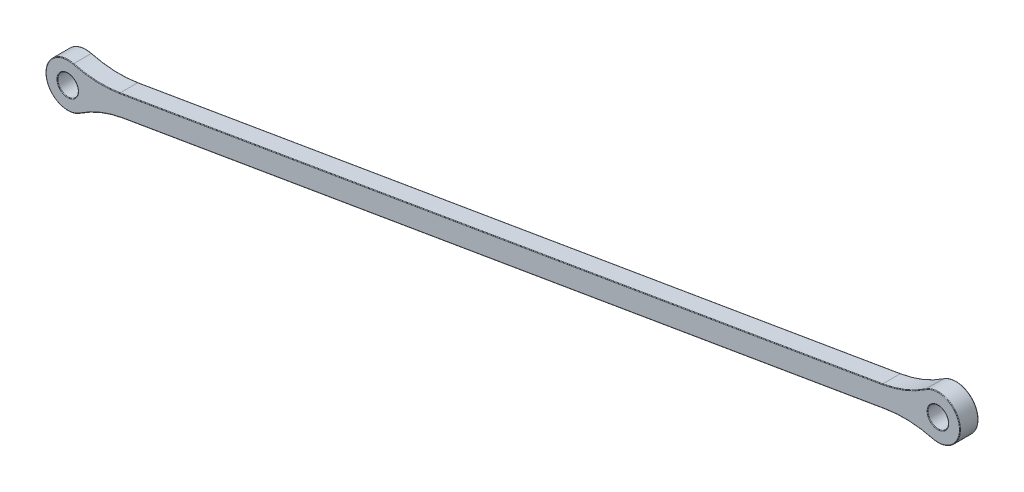
ISO-10303-21;
HEADER;
FILE_DESCRIPTION(('STEP AP214'),'2;1');
FILE_NAME('part.step','',(''),(''),'','','');
FILE_SCHEMA(('AUTOMOTIVE_DESIGN { 1 0 10303 214 1 1 1 1 }'));
ENDSEC;
DATA;
#1=APPLICATION_CONTEXT('core data for automotive mechanical design processes');
#2=APPLICATION_PROTOCOL_DEFINITION('international standard','automotive_design',2000,#1);
#3=PRODUCT_CONTEXT('',#1,'mechanical');
#4=PRODUCT('Part','Part','',(#3));
#5=PRODUCT_RELATED_PRODUCT_CATEGORY('part','',(#4));
#6=PRODUCT_DEFINITION_FORMATION('','',#4);
#7=PRODUCT_DEFINITION_CONTEXT('part definition',#1,'design');
#8=PRODUCT_DEFINITION('design','',#6,#7);
#9=PRODUCT_DEFINITION_SHAPE('','',#8);
#10=(LENGTH_UNIT() NAMED_UNIT(*) SI_UNIT(.MILLI.,.METRE.));
#11=(NAMED_UNIT(*) PLANE_ANGLE_UNIT() SI_UNIT($,.RADIAN.));
#12=(NAMED_UNIT(*) SI_UNIT($,.STERADIAN.) SOLID_ANGLE_UNIT());
#13=UNCERTAINTY_MEASURE_WITH_UNIT(LENGTH_MEASURE(1.E-05),#10,'distance_accuracy_value','');
#14=(GEOMETRIC_REPRESENTATION_CONTEXT(3) GLOBAL_UNCERTAINTY_ASSIGNED_CONTEXT((#13)) GLOBAL_UNIT_ASSIGNED_CONTEXT((#10,
#11,#12)) REPRESENTATION_CONTEXT('',''));
#15=CARTESIAN_POINT('',(0.,0.,0.));
#16=DIRECTION('',(0.,0.,1.));
#17=DIRECTION('',(1.,0.,0.));
#18=AXIS2_PLACEMENT_3D('',#15,#16,#17);
#19=CARTESIAN_POINT('',(-307.976278264637,263.097982683496,-5.));
#20=DIRECTION('',(0.,0.,1.));
#21=DIRECTION('',(1.,0.,0.));
#22=AXIS2_PLACEMENT_3D('',#19,#20,#21);
#23=CYLINDRICAL_SURFACE('',#22,5.99999999999999);
#24=DIRECTION('',(0.,0.,1.));
#25=VECTOR('',#24,1.);
#26=CARTESIAN_POINT('',(-304.624369753048,258.121567374266,-5.));
#27=LINE('',#26,#25);
#28=CARTESIAN_POINT('',(-304.624369753048,258.121567374266,-4.85));
#29=VERTEX_POINT('',#28);
#30=CARTESIAN_POINT('',(-304.624369753048,258.121567374266,-0.15));
#31=VERTEX_POINT('',#30);
#32=EDGE_CURVE('E347',#29,#31,#27,.T.);
#33=ORIENTED_EDGE('',*,*,#32,.T.);
#34=CARTESIAN_POINT('',(-307.976278264637,263.097982683496,-0.15));
#35=DIRECTION('',(0.,0.,1.));
#36=DIRECTION('',(1.,0.,0.));
#37=AXIS2_PLACEMENT_3D('',#34,#35,#36);
#38=CIRCLE('',#37,5.99999999999999);
#39=CARTESIAN_POINT('',(-306.451835718125,268.901091757292,-0.15));
#40=VERTEX_POINT('',#39);
#41=EDGE_CURVE('E211',#31,#40,#38,.F.);
#42=ORIENTED_EDGE('',*,*,#41,.T.);
#43=DIRECTION('',(0.,0.,1.));
#44=VECTOR('',#43,1.);
#45=CARTESIAN_POINT('',(-306.451835718125,268.901091757292,-5.));
#46=LINE('',#45,#44);
#47=CARTESIAN_POINT('',(-306.451835718125,268.901091757292,-4.85));
#48=VERTEX_POINT('',#47);
#49=EDGE_CURVE('E260',#40,#48,#46,.F.);
#50=ORIENTED_EDGE('',*,*,#49,.T.);
#51=CARTESIAN_POINT('',(-307.976278264637,263.097982683496,-4.85));
#52=DIRECTION('',(0.,0.,1.));
#53=DIRECTION('',(1.,0.,0.));
#54=AXIS2_PLACEMENT_3D('',#51,#52,#53);
#55=CIRCLE('',#54,5.99999999999999);
#56=EDGE_CURVE('E209',#48,#29,#55,.T.);
#57=ORIENTED_EDGE('',*,*,#56,.T.);
#58=EDGE_LOOP('',(#33,#42,#50,#57));
#59=FACE_BOUND('',#58,.T.);
#60=ADVANCED_FACE('F39',(#59),#23,.T.);
#61=CARTESIAN_POINT('',(-52.4294141619899,309.261107537726,-5.));
#62=DIRECTION('',(0.167146277293557,-0.985932108203656,0.));
#63=DIRECTION('',(0.985932108203656,0.167146277293557,0.));
#64=AXIS2_PLACEMENT_3D('',#61,#62,#63);
#65=PLANE('',#64);
#66=DIRECTION('',(0.,0.,1.));
#67=VECTOR('',#66,1.);
#68=CARTESIAN_POINT('',(-293.815234666754,268.338673880166,-5.));
#69=LINE('',#68,#67);
#70=CARTESIAN_POINT('',(-293.815234666754,268.338673880166,-4.85));
#71=VERTEX_POINT('',#70);
#72=CARTESIAN_POINT('',(-293.815234666754,268.338673880166,-0.15));
#73=VERTEX_POINT('',#72);
#74=EDGE_CURVE('E306',#71,#73,#69,.T.);
#75=ORIENTED_EDGE('',*,*,#74,.T.);
#76=DIRECTION('',(0.985932108203656,0.167146277293557,0.));
#77=VECTOR('',#76,1.);
#78=CARTESIAN_POINT('',(-86.4496350464867,303.493617843219,-0.15));
#79=LINE('',#78,#77);
#80=CARTESIAN_POINT('',(-86.4496350464867,303.493617843219,-0.15));
#81=VERTEX_POINT('',#80);
#82=EDGE_CURVE('E219',#73,#81,#79,.T.);
#83=ORIENTED_EDGE('',*,*,#82,.T.);
#84=DIRECTION('',(0.,0.,1.));
#85=VECTOR('',#84,1.);
#86=CARTESIAN_POINT('',(-86.4496350464867,303.493617843219,-5.));
#87=LINE('',#86,#85);
#88=CARTESIAN_POINT('',(-86.4496350464867,303.493617843219,-4.85));
#89=VERTEX_POINT('',#88);
#90=EDGE_CURVE('E298',#81,#89,#87,.F.);
#91=ORIENTED_EDGE('',*,*,#90,.T.);
#92=DIRECTION('',(0.985932108203656,0.167146277293557,0.));
#93=VECTOR('',#92,1.);
#94=CARTESIAN_POINT('',(-52.4294141619899,309.261107537726,-4.85));
#95=LINE('',#94,#93);
#96=EDGE_CURVE('E217',#89,#71,#95,.F.);
#97=ORIENTED_EDGE('',*,*,#96,.T.);
#98=EDGE_LOOP('',(#75,#83,#91,#97));
#99=FACE_BOUND('',#98,.T.);
#100=ADVANCED_FACE('F303',(#99),#65,.F.);
#101=CARTESIAN_POINT('',(-71.3525722957598,303.213089233949,-5.));
#102=DIRECTION('',(0.,0.,1.));
#103=DIRECTION('',(1.,0.,0.));
#104=AXIS2_PLACEMENT_3D('',#101,#102,#103);
#105=CYLINDRICAL_SURFACE('',#104,6.);
#106=DIRECTION('',(0.,0.,1.));
#107=VECTOR('',#106,1.);
#108=CARTESIAN_POINT('',(-74.7044808073487,308.189504543179,-5.));
#109=LINE('',#108,#107);
#110=CARTESIAN_POINT('',(-74.7044808073487,308.189504543179,-4.85));
#111=VERTEX_POINT('',#110);
#112=CARTESIAN_POINT('',(-74.7044808073487,308.189504543179,-0.15));
#113=VERTEX_POINT('',#112);
#114=EDGE_CURVE('E300',#111,#113,#109,.T.);
#115=ORIENTED_EDGE('',*,*,#114,.T.);
#116=CARTESIAN_POINT('',(-71.3525722957598,303.213089233949,-0.15));
#117=DIRECTION('',(0.,0.,1.));
#118=DIRECTION('',(1.,0.,0.));
#119=AXIS2_PLACEMENT_3D('',#116,#117,#118);
#120=CIRCLE('',#119,6.);
#121=CARTESIAN_POINT('',(-72.8770148422724,297.409980160153,-0.15));
#122=VERTEX_POINT('',#121);
#123=EDGE_CURVE('E194',#113,#122,#120,.F.);
#124=ORIENTED_EDGE('',*,*,#123,.T.);
#125=DIRECTION('',(0.,0.,1.));
#126=VECTOR('',#125,1.);
#127=CARTESIAN_POINT('',(-72.8770148422724,297.409980160153,-5.));
#128=LINE('',#127,#126);
#129=CARTESIAN_POINT('',(-72.8770148422724,297.409980160153,-4.85));
#130=VERTEX_POINT('',#129);
#131=EDGE_CURVE('E311',#122,#130,#128,.F.);
#132=ORIENTED_EDGE('',*,*,#131,.T.);
#133=CARTESIAN_POINT('',(-71.3525722957598,303.213089233949,-4.85));
#134=DIRECTION('',(0.,0.,1.));
#135=DIRECTION('',(1.,0.,0.));
#136=AXIS2_PLACEMENT_3D('',#133,#134,#135);
#137=CIRCLE('',#136,6.);
#138=EDGE_CURVE('E192',#130,#111,#137,.T.);
#139=ORIENTED_EDGE('',*,*,#138,.T.);
#140=EDGE_LOOP('',(#115,#124,#132,#139));
#141=FACE_BOUND('',#140,.T.);
#142=ADVANCED_FACE('F338',(#141),#105,.T.);
#143=CARTESIAN_POINT('',(-51.493395009146,303.739887731786,-5.));
#144=DIRECTION('',(0.167146277293557,-0.985932108203656,0.));
#145=DIRECTION('',(0.985932108203656,0.167146277293557,0.));
#146=AXIS2_PLACEMENT_3D('',#143,#144,#145);
#147=PLANE('',#146);
#148=DIRECTION('',(0.,0.,-1.));
#149=VECTOR('',#148,1.);
#150=CARTESIAN_POINT('',(-85.5136158936422,297.972398037279,0.));
#151=LINE('',#150,#149);
#152=CARTESIAN_POINT('',(-85.5136158936422,297.972398037279,-4.85));
#153=VERTEX_POINT('',#152);
#154=CARTESIAN_POINT('',(-85.5136158936422,297.972398037279,-0.15));
#155=VERTEX_POINT('',#154);
#156=EDGE_CURVE('E342',#153,#155,#151,.F.);
#157=ORIENTED_EDGE('',*,*,#156,.T.);
#158=DIRECTION('',(0.985932108203656,0.167146277293557,0.));
#159=VECTOR('',#158,1.);
#160=CARTESIAN_POINT('',(-51.493395009146,303.739887731786,-0.15));
#161=LINE('',#160,#159);
#162=CARTESIAN_POINT('',(-292.879215513911,262.817454074226,-0.15));
#163=VERTEX_POINT('',#162);
#164=EDGE_CURVE('E202',#155,#163,#161,.F.);
#165=ORIENTED_EDGE('',*,*,#164,.T.);
#166=DIRECTION('',(0.,0.,-1.));
#167=VECTOR('',#166,1.);
#168=CARTESIAN_POINT('',(-292.879215513911,262.817454074226,-5.));
#169=LINE('',#168,#167);
#170=CARTESIAN_POINT('',(-292.879215513911,262.817454074226,-4.85));
#171=VERTEX_POINT('',#170);
#172=EDGE_CURVE('E339',#163,#171,#169,.T.);
#173=ORIENTED_EDGE('',*,*,#172,.T.);
#174=DIRECTION('',(0.985932108203656,0.167146277293557,0.));
#175=VECTOR('',#174,1.);
#176=CARTESIAN_POINT('',(-85.5136158936422,297.972398037279,-4.85));
#177=LINE('',#176,#175);
#178=EDGE_CURVE('E200',#171,#153,#177,.T.);
#179=ORIENTED_EDGE('',*,*,#178,.T.);
#180=EDGE_LOOP('',(#157,#165,#173,#179));
#181=FACE_BOUND('',#180,.T.);
#182=ADVANCED_FACE('F377',(#181),#147,.T.);
#183=CARTESIAN_POINT('',(-71.3525722957597,303.213089233949,-5.));
#184=DIRECTION('',(0.,0.,1.));
#185=DIRECTION('',(1.,0.,0.));
#186=AXIS2_PLACEMENT_3D('',#183,#184,#185);
#187=CYLINDRICAL_SURFACE('',#186,2.80000000000004);
#188=CARTESIAN_POINT('',(-71.3525722957597,303.213089233949,-0.15));
#189=DIRECTION('',(0.,0.,1.));
#190=DIRECTION('',(1.,0.,0.));
#191=AXIS2_PLACEMENT_3D('',#188,#189,#190);
#192=CIRCLE('',#191,2.80000000000004);
#193=CARTESIAN_POINT('',(-68.5525722957597,303.213089233949,-0.15));
#194=VERTEX_POINT('',#193);
#195=EDGE_CURVE('E224',#194,#194,#192,.T.);
#196=ORIENTED_EDGE('',*,*,#195,.T.);
#197=EDGE_LOOP('',(#196));
#198=FACE_BOUND('',#197,.T.);
#199=CARTESIAN_POINT('',(-71.3525722957597,303.213089233949,-4.85));
#200=DIRECTION('',(0.,0.,1.));
#201=DIRECTION('',(1.,0.,0.));
#202=AXIS2_PLACEMENT_3D('',#199,#200,#201);
#203=CIRCLE('',#202,2.80000000000004);
#204=CARTESIAN_POINT('',(-68.5525722957597,303.213089233949,-4.85));
#205=VERTEX_POINT('',#204);
#206=EDGE_CURVE('E221',#205,#205,#203,.F.);
#207=ORIENTED_EDGE('',*,*,#206,.T.);
#208=EDGE_LOOP('',(#207));
#209=FACE_BOUND('',#208,.T.);
#210=ADVANCED_FACE('F420',(#198,#209),#187,.F.);
#211=CARTESIAN_POINT('',(-307.976278264637,263.097982683496,-5.));
#212=DIRECTION('',(0.,0.,1.));
#213=DIRECTION('',(1.,0.,0.));
#214=AXIS2_PLACEMENT_3D('',#211,#212,#213);
#215=CYLINDRICAL_SURFACE('',#214,2.80000000000004);
#216=CARTESIAN_POINT('',(-307.976278264637,263.097982683496,-0.15));
#217=DIRECTION('',(0.,0.,1.));
#218=DIRECTION('',(1.,0.,0.));
#219=AXIS2_PLACEMENT_3D('',#216,#217,#218);
#220=CIRCLE('',#219,2.80000000000004);
#221=CARTESIAN_POINT('',(-305.176278264637,263.097982683496,-0.15));
#222=VERTEX_POINT('',#221);
#223=EDGE_CURVE('E309',#222,#222,#220,.T.);
#224=ORIENTED_EDGE('',*,*,#223,.T.);
#225=EDGE_LOOP('',(#224));
#226=FACE_BOUND('',#225,.T.);
#227=CARTESIAN_POINT('',(-307.976278264637,263.097982683496,-4.85));
#228=DIRECTION('',(0.,0.,1.));
#229=DIRECTION('',(1.,0.,0.));
#230=AXIS2_PLACEMENT_3D('',#227,#228,#229);
#231=CIRCLE('',#230,2.80000000000004);
#232=CARTESIAN_POINT('',(-305.176278264637,263.097982683496,-4.85));
#233=VERTEX_POINT('',#232);
#234=EDGE_CURVE('E305',#233,#233,#231,.F.);
#235=ORIENTED_EDGE('',*,*,#234,.T.);
#236=EDGE_LOOP('',(#235));
#237=FACE_BOUND('',#236,.T.);
#238=ADVANCED_FACE('F423',(#226,#237),#215,.F.);
#239=CARTESIAN_POINT('',(0.,0.,-5.));
#240=DIRECTION('',(0.,0.,1.));
#241=DIRECTION('',(1.,0.,0.));
#242=AXIS2_PLACEMENT_3D('',#239,#240,#241);
#243=PLANE('',#242);
#244=CARTESIAN_POINT('',(-307.976278264637,263.097982683496,-5.));
#245=DIRECTION('',(0.,0.,1.));
#246=DIRECTION('',(1.,0.,0.));
#247=AXIS2_PLACEMENT_3D('',#244,#245,#246);
#248=CIRCLE('',#247,2.95000000000004);
#249=CARTESIAN_POINT('',(-305.026278264637,263.097982683496,-5.));
#250=VERTEX_POINT('',#249);
#251=EDGE_CURVE('E11',#250,#250,#248,.T.);
#252=ORIENTED_EDGE('',*,*,#251,.T.);
#253=EDGE_LOOP('',(#252));
#254=FACE_BOUND('',#253,.T.);
#255=DIRECTION('',(0.985932108203656,0.167146277293557,0.));
#256=VECTOR('',#255,1.);
#257=CARTESIAN_POINT('',(-292.904287455505,262.965343890456,-5.));
#258=LINE('',#257,#256);
#259=CARTESIAN_POINT('',(-85.5386878352363,298.120287853509,-5.));
#260=VERTEX_POINT('',#259);
#261=CARTESIAN_POINT('',(-292.904287455505,262.965343890456,-5.));
#262=VERTEX_POINT('',#261);
#263=EDGE_CURVE('E56',#260,#262,#258,.F.);
#264=ORIENTED_EDGE('',*,*,#263,.T.);
#265=CARTESIAN_POINT('',(-287.864827195104,233.239490828116,-5.));
#266=DIRECTION('',(0.,0.,1.));
#267=DIRECTION('',(1.,0.,0.));
#268=AXIS2_PLACEMENT_3D('',#265,#266,#267);
#269=CIRCLE('',#268,30.15);
#270=CARTESIAN_POINT('',(-304.708167465838,258.245977756997,-5.));
#271=VERTEX_POINT('',#270);
#272=EDGE_CURVE('E48',#262,#271,#269,.T.);
#273=ORIENTED_EDGE('',*,*,#272,.T.);
#274=CARTESIAN_POINT('',(-307.976278264637,263.097982683496,-5.));
#275=DIRECTION('',(0.,0.,1.));
#276=DIRECTION('',(1.,0.,0.));
#277=AXIS2_PLACEMENT_3D('',#274,#275,#276);
#278=CIRCLE('',#277,5.84999999999999);
#279=CARTESIAN_POINT('',(-306.489946781787,268.756014030448,-5.));
#280=VERTEX_POINT('',#279);
#281=EDGE_CURVE('E230',#271,#280,#278,.F.);
#282=ORIENTED_EDGE('',*,*,#281,.T.);
#283=CARTESIAN_POINT('',(-298.829622985561,297.916637126276,-5.));
#284=DIRECTION('',(0.,0.,1.));
#285=DIRECTION('',(1.,0.,0.));
#286=AXIS2_PLACEMENT_3D('',#283,#284,#285);
#287=CIRCLE('',#286,30.15);
#288=CARTESIAN_POINT('',(-293.79016272516,268.190784063936,-5.));
#289=VERTEX_POINT('',#288);
#290=EDGE_CURVE('E232',#280,#289,#287,.T.);
#291=ORIENTED_EDGE('',*,*,#290,.T.);
#292=DIRECTION('',(0.985932108203656,0.167146277293557,0.));
#293=VECTOR('',#292,1.);
#294=CARTESIAN_POINT('',(-52.4043422203959,309.113217721496,-5.));
#295=LINE('',#294,#293);
#296=CARTESIAN_POINT('',(-86.4245631048926,303.345728026989,-5.));
#297=VERTEX_POINT('',#296);
#298=EDGE_CURVE('E234',#289,#297,#295,.T.);
#299=ORIENTED_EDGE('',*,*,#298,.T.);
#300=CARTESIAN_POINT('',(-91.4640233652934,333.071581089329,-5.));
#301=DIRECTION('',(0.,0.,1.));
#302=DIRECTION('',(1.,0.,0.));
#303=AXIS2_PLACEMENT_3D('',#300,#301,#302);
#304=CIRCLE('',#303,30.15);
#305=CARTESIAN_POINT('',(-74.620683094559,308.065094160449,-5.));
#306=VERTEX_POINT('',#305);
#307=EDGE_CURVE('E236',#297,#306,#304,.T.);
#308=ORIENTED_EDGE('',*,*,#307,.T.);
#309=CARTESIAN_POINT('',(-71.3525722957598,303.213089233949,-5.));
#310=DIRECTION('',(0.,0.,1.));
#311=DIRECTION('',(1.,0.,0.));
#312=AXIS2_PLACEMENT_3D('',#309,#310,#311);
#313=CIRCLE('',#312,5.85);
#314=CARTESIAN_POINT('',(-72.8389037786096,297.555057886998,-5.));
#315=VERTEX_POINT('',#314);
#316=EDGE_CURVE('E238',#306,#315,#313,.F.);
#317=ORIENTED_EDGE('',*,*,#316,.T.);
#318=CARTESIAN_POINT('',(-80.4992275748355,268.394434791169,-5.));
#319=DIRECTION('',(0.,0.,1.));
#320=DIRECTION('',(1.,0.,0.));
#321=AXIS2_PLACEMENT_3D('',#318,#319,#320);
#322=CIRCLE('',#321,30.15);
#323=EDGE_CURVE('E61',#315,#260,#322,.T.);
#324=ORIENTED_EDGE('',*,*,#323,.T.);
#325=EDGE_LOOP('',(#264,#273,#282,#291,#299,#308,#317,#324));
#326=FACE_BOUND('',#325,.T.);
#327=CARTESIAN_POINT('',(-71.3525722957597,303.213089233949,-5.));
#328=DIRECTION('',(0.,0.,1.));
#329=DIRECTION('',(1.,0.,0.));
#330=AXIS2_PLACEMENT_3D('',#327,#328,#329);
#331=CIRCLE('',#330,2.95000000000004);
#332=CARTESIAN_POINT('',(-68.4025722957597,303.213089233949,-5.));
#333=VERTEX_POINT('',#332);
#334=EDGE_CURVE('E227',#333,#333,#331,.T.);
#335=ORIENTED_EDGE('',*,*,#334,.T.);
#336=EDGE_LOOP('',(#335));
#337=FACE_BOUND('',#336,.T.);
#338=ADVANCED_FACE('F396',(#254,#326,#337),#243,.F.);
#339=CARTESIAN_POINT('',(0.,0.,0.));
#340=DIRECTION('',(0.,0.,1.));
#341=DIRECTION('',(1.,0.,0.));
#342=AXIS2_PLACEMENT_3D('',#339,#340,#341);
#343=PLANE('',#342);
#344=CARTESIAN_POINT('',(-307.976278264637,263.097982683496,0.));
#345=DIRECTION('',(0.,0.,1.));
#346=DIRECTION('',(1.,0.,0.));
#347=AXIS2_PLACEMENT_3D('',#344,#345,#346);
#348=CIRCLE('',#347,2.95000000000004);
#349=CARTESIAN_POINT('',(-305.026278264637,263.097982683496,0.));
#350=VERTEX_POINT('',#349);
#351=EDGE_CURVE('E181',#350,#350,#348,.F.);
#352=ORIENTED_EDGE('',*,*,#351,.T.);
#353=EDGE_LOOP('',(#352));
#354=FACE_BOUND('',#353,.T.);
#355=CARTESIAN_POINT('',(-71.3525722957598,303.213089233949,0.));
#356=DIRECTION('',(0.,0.,1.));
#357=DIRECTION('',(1.,0.,0.));
#358=AXIS2_PLACEMENT_3D('',#355,#356,#357);
#359=CIRCLE('',#358,5.85);
#360=CARTESIAN_POINT('',(-72.8389037786096,297.555057886998,0.));
#361=VERTEX_POINT('',#360);
#362=CARTESIAN_POINT('',(-74.620683094559,308.065094160449,0.));
#363=VERTEX_POINT('',#362);
#364=EDGE_CURVE('E179',#361,#363,#359,.T.);
#365=ORIENTED_EDGE('',*,*,#364,.T.);
#366=CARTESIAN_POINT('',(-91.4640233652934,333.071581089329,0.));
#367=DIRECTION('',(0.,0.,1.));
#368=DIRECTION('',(1.,0.,0.));
#369=AXIS2_PLACEMENT_3D('',#366,#367,#368);
#370=CIRCLE('',#369,30.15);
#371=CARTESIAN_POINT('',(-86.4245631048926,303.345728026989,0.));
#372=VERTEX_POINT('',#371);
#373=EDGE_CURVE('E159',#363,#372,#370,.F.);
#374=ORIENTED_EDGE('',*,*,#373,.T.);
#375=DIRECTION('',(0.985932108203656,0.167146277293557,0.));
#376=VECTOR('',#375,1.);
#377=CARTESIAN_POINT('',(-293.79016272516,268.190784063936,0.));
#378=LINE('',#377,#376);
#379=CARTESIAN_POINT('',(-293.79016272516,268.190784063936,0.));
#380=VERTEX_POINT('',#379);
#381=EDGE_CURVE('E167',#372,#380,#378,.F.);
#382=ORIENTED_EDGE('',*,*,#381,.T.);
#383=CARTESIAN_POINT('',(-298.829622985561,297.916637126276,0.));
#384=DIRECTION('',(0.,0.,1.));
#385=DIRECTION('',(1.,0.,0.));
#386=AXIS2_PLACEMENT_3D('',#383,#384,#385);
#387=CIRCLE('',#386,30.15);
#388=CARTESIAN_POINT('',(-306.489946781787,268.756014030448,0.));
#389=VERTEX_POINT('',#388);
#390=EDGE_CURVE('E173',#380,#389,#387,.F.);
#391=ORIENTED_EDGE('',*,*,#390,.T.);
#392=CARTESIAN_POINT('',(-307.976278264637,263.097982683496,0.));
#393=DIRECTION('',(0.,0.,1.));
#394=DIRECTION('',(1.,0.,0.));
#395=AXIS2_PLACEMENT_3D('',#392,#393,#394);
#396=CIRCLE('',#395,5.84999999999999);
#397=CARTESIAN_POINT('',(-304.708167465838,258.245977756997,0.));
#398=VERTEX_POINT('',#397);
#399=EDGE_CURVE('E320',#389,#398,#396,.T.);
#400=ORIENTED_EDGE('',*,*,#399,.T.);
#401=CARTESIAN_POINT('',(-287.864827195104,233.239490828116,0.));
#402=DIRECTION('',(0.,0.,1.));
#403=DIRECTION('',(1.,0.,0.));
#404=AXIS2_PLACEMENT_3D('',#401,#402,#403);
#405=CIRCLE('',#404,30.15);
#406=CARTESIAN_POINT('',(-292.904287455505,262.965343890456,0.));
#407=VERTEX_POINT('',#406);
#408=EDGE_CURVE('E322',#398,#407,#405,.F.);
#409=ORIENTED_EDGE('',*,*,#408,.T.);
#410=DIRECTION('',(0.985932108203656,0.167146277293557,0.));
#411=VECTOR('',#410,1.);
#412=CARTESIAN_POINT('',(-51.51846695074,303.887777548016,0.));
#413=LINE('',#412,#411);
#414=CARTESIAN_POINT('',(-85.5386878352363,298.120287853509,0.));
#415=VERTEX_POINT('',#414);
#416=EDGE_CURVE('E324',#407,#415,#413,.T.);
#417=ORIENTED_EDGE('',*,*,#416,.T.);
#418=CARTESIAN_POINT('',(-80.4992275748355,268.394434791169,0.));
#419=DIRECTION('',(0.,0.,1.));
#420=DIRECTION('',(1.,0.,0.));
#421=AXIS2_PLACEMENT_3D('',#418,#419,#420);
#422=CIRCLE('',#421,30.15);
#423=EDGE_CURVE('E186',#415,#361,#422,.F.);
#424=ORIENTED_EDGE('',*,*,#423,.T.);
#425=EDGE_LOOP('',(#365,#374,#382,#391,#400,#409,#417,#424));
#426=FACE_BOUND('',#425,.T.);
#427=CARTESIAN_POINT('',(-71.3525722957597,303.213089233949,0.));
#428=DIRECTION('',(0.,0.,1.));
#429=DIRECTION('',(1.,0.,0.));
#430=AXIS2_PLACEMENT_3D('',#427,#428,#429);
#431=CIRCLE('',#430,2.95000000000004);
#432=CARTESIAN_POINT('',(-68.4025722957597,303.213089233949,0.));
#433=VERTEX_POINT('',#432);
#434=EDGE_CURVE('E174',#433,#433,#431,.F.);
#435=ORIENTED_EDGE('',*,*,#434,.T.);
#436=EDGE_LOOP('',(#435));
#437=FACE_BOUND('',#436,.T.);
#438=ADVANCED_FACE('F176',(#354,#426,#437),#343,.T.);
#439=CARTESIAN_POINT('',(-287.864827195104,233.239490828116,-5.));
#440=DIRECTION('',(0.,0.,1.));
#441=DIRECTION('',(1.,0.,0.));
#442=AXIS2_PLACEMENT_3D('',#439,#440,#441);
#443=CYLINDRICAL_SURFACE('',#442,30.);
#444=ORIENTED_EDGE('',*,*,#172,.F.);
#445=CARTESIAN_POINT('',(-287.864827195104,233.239490828116,-0.15));
#446=DIRECTION('',(0.,0.,1.));
#447=DIRECTION('',(1.,0.,0.));
#448=AXIS2_PLACEMENT_3D('',#445,#446,#447);
#449=CIRCLE('',#448,30.);
#450=EDGE_CURVE('E207',#163,#31,#449,.T.);
#451=ORIENTED_EDGE('',*,*,#450,.T.);
#452=ORIENTED_EDGE('',*,*,#32,.F.);
#453=CARTESIAN_POINT('',(-287.864827195104,233.239490828116,-4.85));
#454=DIRECTION('',(0.,0.,1.));
#455=DIRECTION('',(1.,0.,0.));
#456=AXIS2_PLACEMENT_3D('',#453,#454,#455);
#457=CIRCLE('',#456,30.);
#458=EDGE_CURVE('E204',#29,#171,#457,.F.);
#459=ORIENTED_EDGE('',*,*,#458,.T.);
#460=EDGE_LOOP('',(#444,#451,#452,#459));
#461=FACE_BOUND('',#460,.T.);
#462=ADVANCED_FACE('F374',(#461),#443,.F.);
#463=CARTESIAN_POINT('',(-80.4992275748355,268.394434791169,-5.));
#464=DIRECTION('',(0.,0.,1.));
#465=DIRECTION('',(1.,0.,0.));
#466=AXIS2_PLACEMENT_3D('',#463,#464,#465);
#467=CYLINDRICAL_SURFACE('',#466,30.);
#468=ORIENTED_EDGE('',*,*,#131,.F.);
#469=CARTESIAN_POINT('',(-80.4992275748355,268.394434791169,-0.15));
#470=DIRECTION('',(0.,0.,1.));
#471=DIRECTION('',(1.,0.,0.));
#472=AXIS2_PLACEMENT_3D('',#469,#470,#471);
#473=CIRCLE('',#472,30.);
#474=EDGE_CURVE('E198',#122,#155,#473,.T.);
#475=ORIENTED_EDGE('',*,*,#474,.T.);
#476=ORIENTED_EDGE('',*,*,#156,.F.);
#477=CARTESIAN_POINT('',(-80.4992275748355,268.394434791169,-4.85));
#478=DIRECTION('',(0.,0.,1.));
#479=DIRECTION('',(1.,0.,0.));
#480=AXIS2_PLACEMENT_3D('',#477,#478,#479);
#481=CIRCLE('',#480,30.);
#482=EDGE_CURVE('E196',#153,#130,#481,.F.);
#483=ORIENTED_EDGE('',*,*,#482,.T.);
#484=EDGE_LOOP('',(#468,#475,#476,#483));
#485=FACE_BOUND('',#484,.T.);
#486=ADVANCED_FACE('F427',(#485),#467,.F.);
#487=CARTESIAN_POINT('',(-91.4640233652934,333.071581089329,-5.));
#488=DIRECTION('',(0.,0.,1.));
#489=DIRECTION('',(1.,0.,0.));
#490=AXIS2_PLACEMENT_3D('',#487,#488,#489);
#491=CYLINDRICAL_SURFACE('',#490,30.);
#492=ORIENTED_EDGE('',*,*,#90,.F.);
#493=CARTESIAN_POINT('',(-91.4640233652934,333.071581089329,-0.15));
#494=DIRECTION('',(0.,0.,1.));
#495=DIRECTION('',(1.,0.,0.));
#496=AXIS2_PLACEMENT_3D('',#493,#494,#495);
#497=CIRCLE('',#496,30.);
#498=EDGE_CURVE('E161',#81,#113,#497,.T.);
#499=ORIENTED_EDGE('',*,*,#498,.T.);
#500=ORIENTED_EDGE('',*,*,#114,.F.);
#501=CARTESIAN_POINT('',(-91.4640233652934,333.071581089329,-4.85));
#502=DIRECTION('',(0.,0.,1.));
#503=DIRECTION('',(1.,0.,0.));
#504=AXIS2_PLACEMENT_3D('',#501,#502,#503);
#505=CIRCLE('',#504,30.);
#506=EDGE_CURVE('E184',#111,#89,#505,.F.);
#507=ORIENTED_EDGE('',*,*,#506,.T.);
#508=EDGE_LOOP('',(#492,#499,#500,#507));
#509=FACE_BOUND('',#508,.T.);
#510=ADVANCED_FACE('F297',(#509),#491,.F.);
#511=CARTESIAN_POINT('',(-298.829622985561,297.916637126276,-5.));
#512=DIRECTION('',(0.,0.,1.));
#513=DIRECTION('',(1.,0.,0.));
#514=AXIS2_PLACEMENT_3D('',#511,#512,#513);
#515=CYLINDRICAL_SURFACE('',#514,30.);
#516=ORIENTED_EDGE('',*,*,#49,.F.);
#517=CARTESIAN_POINT('',(-298.829622985561,297.916637126276,-0.15));
#518=DIRECTION('',(0.,0.,1.));
#519=DIRECTION('',(1.,0.,0.));
#520=AXIS2_PLACEMENT_3D('',#517,#518,#519);
#521=CIRCLE('',#520,30.);
#522=EDGE_CURVE('E215',#40,#73,#521,.T.);
#523=ORIENTED_EDGE('',*,*,#522,.T.);
#524=ORIENTED_EDGE('',*,*,#74,.F.);
#525=CARTESIAN_POINT('',(-298.829622985561,297.916637126276,-4.85));
#526=DIRECTION('',(0.,0.,1.));
#527=DIRECTION('',(1.,0.,0.));
#528=AXIS2_PLACEMENT_3D('',#525,#526,#527);
#529=CIRCLE('',#528,30.);
#530=EDGE_CURVE('E213',#71,#48,#529,.F.);
#531=ORIENTED_EDGE('',*,*,#530,.T.);
#532=EDGE_LOOP('',(#516,#523,#524,#531));
#533=FACE_BOUND('',#532,.T.);
#534=ADVANCED_FACE('F393',(#533),#515,.F.);
#535=CARTESIAN_POINT('',(-307.976278264637,263.097982683496,-0.15));
#536=DIRECTION('',(0.,0.,1.));
#537=DIRECTION('',(1.,0.,0.));
#538=AXIS2_PLACEMENT_3D('',#535,#536,#537);
#539=TOROIDAL_SURFACE('',#538,2.95000000000004,0.15);
#540=ORIENTED_EDGE('',*,*,#351,.F.);
#541=EDGE_LOOP('',(#540));
#542=FACE_BOUND('',#541,.T.);
#543=ORIENTED_EDGE('',*,*,#223,.F.);
#544=EDGE_LOOP('',(#543));
#545=FACE_BOUND('',#544,.T.);
#546=ADVANCED_FACE('F435',(#542,#545),#539,.T.);
#547=CARTESIAN_POINT('',(-287.864827195104,233.239490828116,-0.15));
#548=DIRECTION('',(0.,0.,1.));
#549=DIRECTION('',(1.,0.,0.));
#550=AXIS2_PLACEMENT_3D('',#547,#548,#549);
#551=TOROIDAL_SURFACE('',#550,30.15,0.15);
#552=CARTESIAN_POINT('',(-304.708167465838,258.245977756997,-0.15));
#553=DIRECTION('',(-0.829402551538365,-0.558651418598083,0.));
#554=DIRECTION('',(0.558651418598083,-0.829402551538365,0.));
#555=AXIS2_PLACEMENT_3D('',#552,#553,#554);
#556=CIRCLE('',#555,0.15);
#557=EDGE_CURVE('E254',#31,#398,#556,.T.);
#558=ORIENTED_EDGE('',*,*,#557,.F.);
#559=ORIENTED_EDGE('',*,*,#450,.F.);
#560=CARTESIAN_POINT('',(-292.904287455505,262.965343890456,-0.15));
#561=DIRECTION('',(0.985932108203677,0.167146277293431,0.));
#562=DIRECTION('',(-0.167146277293431,0.985932108203677,0.));
#563=AXIS2_PLACEMENT_3D('',#560,#561,#562);
#564=CIRCLE('',#563,0.15);
#565=EDGE_CURVE('E257',#407,#163,#564,.T.);
#566=ORIENTED_EDGE('',*,*,#565,.F.);
#567=ORIENTED_EDGE('',*,*,#408,.F.);
#568=EDGE_LOOP('',(#558,#559,#566,#567));
#569=FACE_BOUND('',#568,.T.);
#570=ADVANCED_FACE('F386',(#569),#551,.T.);
#571=CARTESIAN_POINT('',(-51.51846695074,303.887777548016,-0.15));
#572=DIRECTION('',(0.985932108203656,0.167146277293557,0.));
#573=DIRECTION('',(-0.167146277293557,0.985932108203656,0.));
#574=AXIS2_PLACEMENT_3D('',#571,#572,#573);
#575=CYLINDRICAL_SURFACE('',#574,0.15);
#576=ORIENTED_EDGE('',*,*,#565,.T.);
#577=ORIENTED_EDGE('',*,*,#164,.F.);
#578=CARTESIAN_POINT('',(-85.5386878352363,298.120287853509,-0.15));
#579=DIRECTION('',(0.985932108203647,0.167146277293611,0.));
#580=DIRECTION('',(-0.167146277293611,0.985932108203647,0.));
#581=AXIS2_PLACEMENT_3D('',#578,#579,#580);
#582=CIRCLE('',#581,0.15);
#583=EDGE_CURVE('E251',#415,#155,#582,.T.);
#584=ORIENTED_EDGE('',*,*,#583,.F.);
#585=ORIENTED_EDGE('',*,*,#416,.F.);
#586=EDGE_LOOP('',(#576,#577,#584,#585));
#587=FACE_BOUND('',#586,.T.);
#588=ADVANCED_FACE('F381',(#587),#575,.T.);
#589=CARTESIAN_POINT('',(-307.976278264637,263.097982683496,-0.15));
#590=DIRECTION('',(0.,0.,1.));
#591=DIRECTION('',(1.,0.,0.));
#592=AXIS2_PLACEMENT_3D('',#589,#590,#591);
#593=TOROIDAL_SURFACE('',#592,5.84999999999999,0.15);
#594=ORIENTED_EDGE('',*,*,#557,.T.);
#595=ORIENTED_EDGE('',*,*,#399,.F.);
#596=CARTESIAN_POINT('',(-306.489946781787,268.756014030448,-0.15));
#597=DIRECTION('',(0.967184845632805,-0.254073757752048,0.));
#598=DIRECTION('',(0.254073757752048,0.967184845632805,0.));
#599=AXIS2_PLACEMENT_3D('',#596,#597,#598);
#600=CIRCLE('',#599,0.15);
#601=EDGE_CURVE('E248',#40,#389,#600,.T.);
#602=ORIENTED_EDGE('',*,*,#601,.F.);
#603=ORIENTED_EDGE('',*,*,#41,.F.);
#604=EDGE_LOOP('',(#594,#595,#602,#603));
#605=FACE_BOUND('',#604,.T.);
#606=ADVANCED_FACE('F389',(#605),#593,.T.);
#607=CARTESIAN_POINT('',(-80.4992275748355,268.394434791169,-0.15));
#608=DIRECTION('',(0.,0.,1.));
#609=DIRECTION('',(1.,0.,0.));
#610=AXIS2_PLACEMENT_3D('',#607,#608,#609);
#611=TOROIDAL_SURFACE('',#610,30.15,0.15);
#612=ORIENTED_EDGE('',*,*,#583,.T.);
#613=ORIENTED_EDGE('',*,*,#474,.F.);
#614=CARTESIAN_POINT('',(-72.8389037786096,297.555057886998,-0.15));
#615=DIRECTION('',(0.967184845632783,-0.254073757752134,0.));
#616=DIRECTION('',(0.254073757752134,0.967184845632783,0.));
#617=AXIS2_PLACEMENT_3D('',#614,#615,#616);
#618=CIRCLE('',#617,0.15);
#619=EDGE_CURVE('E245',#361,#122,#618,.T.);
#620=ORIENTED_EDGE('',*,*,#619,.F.);
#621=ORIENTED_EDGE('',*,*,#423,.F.);
#622=EDGE_LOOP('',(#612,#613,#620,#621));
#623=FACE_BOUND('',#622,.T.);
#624=ADVANCED_FACE('F331',(#623),#611,.T.);
#625=CARTESIAN_POINT('',(-298.829622985561,297.916637126276,-0.15));
#626=DIRECTION('',(0.,0.,1.));
#627=DIRECTION('',(1.,0.,0.));
#628=AXIS2_PLACEMENT_3D('',#625,#626,#627);
#629=TOROIDAL_SURFACE('',#628,30.15,0.15);
#630=ORIENTED_EDGE('',*,*,#601,.T.);
#631=ORIENTED_EDGE('',*,*,#390,.F.);
#632=CARTESIAN_POINT('',(-293.79016272516,268.190784063936,-0.15));
#633=DIRECTION('',(0.985932108203677,0.167146277293431,0.));
#634=DIRECTION('',(-0.167146277293431,0.985932108203677,0.));
#635=AXIS2_PLACEMENT_3D('',#632,#633,#634);
#636=CIRCLE('',#635,0.15);
#637=EDGE_CURVE('E170',#73,#380,#636,.T.);
#638=ORIENTED_EDGE('',*,*,#637,.F.);
#639=ORIENTED_EDGE('',*,*,#522,.F.);
#640=EDGE_LOOP('',(#630,#631,#638,#639));
#641=FACE_BOUND('',#640,.T.);
#642=ADVANCED_FACE('F392',(#641),#629,.T.);
#643=CARTESIAN_POINT('',(-71.3525722957598,303.213089233949,-0.15));
#644=DIRECTION('',(0.,0.,1.));
#645=DIRECTION('',(1.,0.,0.));
#646=AXIS2_PLACEMENT_3D('',#643,#644,#645);
#647=TOROIDAL_SURFACE('',#646,5.85,0.15);
#648=ORIENTED_EDGE('',*,*,#619,.T.);
#649=ORIENTED_EDGE('',*,*,#123,.F.);
#650=CARTESIAN_POINT('',(-74.620683094559,308.065094160449,-0.15));
#651=DIRECTION('',(-0.829402551538322,-0.558651418598146,0.));
#652=DIRECTION('',(0.558651418598146,-0.829402551538322,0.));
#653=AXIS2_PLACEMENT_3D('',#650,#651,#652);
#654=CIRCLE('',#653,0.15);
#655=EDGE_CURVE('E164',#363,#113,#654,.T.);
#656=ORIENTED_EDGE('',*,*,#655,.F.);
#657=ORIENTED_EDGE('',*,*,#364,.F.);
#658=EDGE_LOOP('',(#648,#649,#656,#657));
#659=FACE_BOUND('',#658,.T.);
#660=ADVANCED_FACE('F334',(#659),#647,.T.);
#661=CARTESIAN_POINT('',(-52.4043422203959,309.113217721496,-0.15));
#662=DIRECTION('',(-0.985932108203656,-0.167146277293557,0.));
#663=DIRECTION('',(0.167146277293557,-0.985932108203656,0.));
#664=AXIS2_PLACEMENT_3D('',#661,#662,#663);
#665=CYLINDRICAL_SURFACE('',#664,0.15);
#666=ORIENTED_EDGE('',*,*,#637,.T.);
#667=ORIENTED_EDGE('',*,*,#381,.F.);
#668=CARTESIAN_POINT('',(-86.4245631048926,303.345728026989,-0.15));
#669=DIRECTION('',(0.985932108203647,0.167146277293611,0.));
#670=DIRECTION('',(-0.167146277293611,0.985932108203647,0.));
#671=AXIS2_PLACEMENT_3D('',#668,#669,#670);
#672=CIRCLE('',#671,0.15);
#673=EDGE_CURVE('E155',#81,#372,#672,.T.);
#674=ORIENTED_EDGE('',*,*,#673,.F.);
#675=ORIENTED_EDGE('',*,*,#82,.F.);
#676=EDGE_LOOP('',(#666,#667,#674,#675));
#677=FACE_BOUND('',#676,.T.);
#678=ADVANCED_FACE('F168',(#677),#665,.T.);
#679=CARTESIAN_POINT('',(-91.4640233652934,333.071581089329,-0.15));
#680=DIRECTION('',(0.,0.,1.));
#681=DIRECTION('',(1.,0.,0.));
#682=AXIS2_PLACEMENT_3D('',#679,#680,#681);
#683=TOROIDAL_SURFACE('',#682,30.15,0.15);
#684=ORIENTED_EDGE('',*,*,#655,.T.);
#685=ORIENTED_EDGE('',*,*,#498,.F.);
#686=ORIENTED_EDGE('',*,*,#673,.T.);
#687=ORIENTED_EDGE('',*,*,#373,.F.);
#688=EDGE_LOOP('',(#684,#685,#686,#687));
#689=FACE_BOUND('',#688,.T.);
#690=ADVANCED_FACE('F157',(#689),#683,.T.);
#691=CARTESIAN_POINT('',(-71.3525722957597,303.213089233949,-0.15));
#692=DIRECTION('',(0.,0.,1.));
#693=DIRECTION('',(1.,0.,0.));
#694=AXIS2_PLACEMENT_3D('',#691,#692,#693);
#695=TOROIDAL_SURFACE('',#694,2.95000000000004,0.15);
#696=ORIENTED_EDGE('',*,*,#434,.F.);
#697=EDGE_LOOP('',(#696));
#698=FACE_BOUND('',#697,.T.);
#699=ORIENTED_EDGE('',*,*,#195,.F.);
#700=EDGE_LOOP('',(#699));
#701=FACE_BOUND('',#700,.T.);
#702=ADVANCED_FACE('F441',(#698,#701),#695,.T.);
#703=CARTESIAN_POINT('',(-307.976278264637,263.097982683496,-4.85));
#704=DIRECTION('',(0.,0.,1.));
#705=DIRECTION('',(1.,0.,0.));
#706=AXIS2_PLACEMENT_3D('',#703,#704,#705);
#707=TOROIDAL_SURFACE('',#706,2.95000000000004,0.15);
#708=ORIENTED_EDGE('',*,*,#234,.F.);
#709=EDGE_LOOP('',(#708));
#710=FACE_BOUND('',#709,.T.);
#711=ORIENTED_EDGE('',*,*,#251,.F.);
#712=EDGE_LOOP('',(#711));
#713=FACE_BOUND('',#712,.T.);
#714=ADVANCED_FACE('F458',(#710,#713),#707,.T.);
#715=CARTESIAN_POINT('',(-91.4640233652934,333.071581089329,-4.85));
#716=DIRECTION('',(0.,0.,1.));
#717=DIRECTION('',(1.,0.,0.));
#718=AXIS2_PLACEMENT_3D('',#715,#716,#717);
#719=TOROIDAL_SURFACE('',#718,30.15,0.15);
#720=CARTESIAN_POINT('',(-86.4245631048926,303.345728026989,-4.85));
#721=DIRECTION('',(-0.985932108203647,-0.167146277293611,0.));
#722=DIRECTION('',(0.167146277293611,-0.985932108203647,0.));
#723=AXIS2_PLACEMENT_3D('',#720,#721,#722);
#724=CIRCLE('',#723,0.15);
#725=EDGE_CURVE('E276',#89,#297,#724,.T.);
#726=ORIENTED_EDGE('',*,*,#725,.F.);
#727=ORIENTED_EDGE('',*,*,#506,.F.);
#728=CARTESIAN_POINT('',(-74.620683094559,308.065094160449,-4.85));
#729=DIRECTION('',(0.829402551538365,0.558651418598083,0.));
#730=DIRECTION('',(-0.558651418598083,0.829402551538365,0.));
#731=AXIS2_PLACEMENT_3D('',#728,#729,#730);
#732=CIRCLE('',#731,0.15);
#733=EDGE_CURVE('E43',#306,#111,#732,.T.);
#734=ORIENTED_EDGE('',*,*,#733,.F.);
#735=ORIENTED_EDGE('',*,*,#307,.F.);
#736=EDGE_LOOP('',(#726,#727,#734,#735));
#737=FACE_BOUND('',#736,.T.);
#738=ADVANCED_FACE('F292',(#737),#719,.T.);
#739=CARTESIAN_POINT('',(-71.3525722957598,303.213089233949,-4.85));
#740=DIRECTION('',(0.,0.,1.));
#741=DIRECTION('',(1.,0.,0.));
#742=AXIS2_PLACEMENT_3D('',#739,#740,#741);
#743=TOROIDAL_SURFACE('',#742,5.85,0.15);
#744=ORIENTED_EDGE('',*,*,#733,.T.);
#745=ORIENTED_EDGE('',*,*,#138,.F.);
#746=CARTESIAN_POINT('',(-72.8389037786096,297.555057886998,-4.85));
#747=DIRECTION('',(-0.967184845632783,0.254073757752134,0.));
#748=DIRECTION('',(-0.254073757752134,-0.967184845632783,0.));
#749=AXIS2_PLACEMENT_3D('',#746,#747,#748);
#750=CIRCLE('',#749,0.15);
#751=EDGE_CURVE('E274',#315,#130,#750,.T.);
#752=ORIENTED_EDGE('',*,*,#751,.F.);
#753=ORIENTED_EDGE('',*,*,#316,.F.);
#754=EDGE_LOOP('',(#744,#745,#752,#753));
#755=FACE_BOUND('',#754,.T.);
#756=ADVANCED_FACE('F287',(#755),#743,.T.);
#757=CARTESIAN_POINT('',(-52.4043422203959,309.113217721496,-4.85));
#758=DIRECTION('',(0.985932108203656,0.167146277293557,0.));
#759=DIRECTION('',(-0.167146277293557,0.985932108203656,0.));
#760=AXIS2_PLACEMENT_3D('',#757,#758,#759);
#761=CYLINDRICAL_SURFACE('',#760,0.15);
#762=ORIENTED_EDGE('',*,*,#725,.T.);
#763=ORIENTED_EDGE('',*,*,#298,.F.);
#764=CARTESIAN_POINT('',(-293.79016272516,268.190784063936,-4.85));
#765=DIRECTION('',(-0.985932108203677,-0.167146277293431,0.));
#766=DIRECTION('',(0.167146277293431,-0.985932108203677,0.));
#767=AXIS2_PLACEMENT_3D('',#764,#765,#766);
#768=CIRCLE('',#767,0.15);
#769=EDGE_CURVE('E271',#71,#289,#768,.T.);
#770=ORIENTED_EDGE('',*,*,#769,.F.);
#771=ORIENTED_EDGE('',*,*,#96,.F.);
#772=EDGE_LOOP('',(#762,#763,#770,#771));
#773=FACE_BOUND('',#772,.T.);
#774=ADVANCED_FACE('F395',(#773),#761,.T.);
#775=CARTESIAN_POINT('',(-80.4992275748355,268.394434791169,-4.85));
#776=DIRECTION('',(0.,0.,1.));
#777=DIRECTION('',(1.,0.,0.));
#778=AXIS2_PLACEMENT_3D('',#775,#776,#777);
#779=TOROIDAL_SURFACE('',#778,30.15,0.15);
#780=ORIENTED_EDGE('',*,*,#751,.T.);
#781=ORIENTED_EDGE('',*,*,#482,.F.);
#782=CARTESIAN_POINT('',(-85.5386878352363,298.120287853509,-4.85));
#783=DIRECTION('',(-0.985932108203647,-0.167146277293611,0.));
#784=DIRECTION('',(0.167146277293611,-0.985932108203647,0.));
#785=AXIS2_PLACEMENT_3D('',#782,#783,#784);
#786=CIRCLE('',#785,0.15);
#787=EDGE_CURVE('E268',#260,#153,#786,.T.);
#788=ORIENTED_EDGE('',*,*,#787,.F.);
#789=ORIENTED_EDGE('',*,*,#323,.F.);
#790=EDGE_LOOP('',(#780,#781,#788,#789));
#791=FACE_BOUND('',#790,.T.);
#792=ADVANCED_FACE('F400',(#791),#779,.T.);
#793=CARTESIAN_POINT('',(-298.829622985561,297.916637126276,-4.85));
#794=DIRECTION('',(0.,0.,1.));
#795=DIRECTION('',(1.,0.,0.));
#796=AXIS2_PLACEMENT_3D('',#793,#794,#795);
#797=TOROIDAL_SURFACE('',#796,30.15,0.15);
#798=ORIENTED_EDGE('',*,*,#769,.T.);
#799=ORIENTED_EDGE('',*,*,#290,.F.);
#800=CARTESIAN_POINT('',(-306.489946781787,268.756014030448,-4.85));
#801=DIRECTION('',(-0.967184845632805,0.254073757752048,0.));
#802=DIRECTION('',(-0.254073757752048,-0.967184845632805,0.));
#803=AXIS2_PLACEMENT_3D('',#800,#801,#802);
#804=CIRCLE('',#803,0.15);
#805=EDGE_CURVE('E265',#48,#280,#804,.T.);
#806=ORIENTED_EDGE('',*,*,#805,.F.);
#807=ORIENTED_EDGE('',*,*,#530,.F.);
#808=EDGE_LOOP('',(#798,#799,#806,#807));
#809=FACE_BOUND('',#808,.T.);
#810=ADVANCED_FACE('F362',(#809),#797,.T.);
#811=CARTESIAN_POINT('',(-51.51846695074,303.887777548016,-4.85));
#812=DIRECTION('',(-0.985932108203656,-0.167146277293557,0.));
#813=DIRECTION('',(0.167146277293557,-0.985932108203656,0.));
#814=AXIS2_PLACEMENT_3D('',#811,#812,#813);
#815=CYLINDRICAL_SURFACE('',#814,0.15);
#816=ORIENTED_EDGE('',*,*,#787,.T.);
#817=ORIENTED_EDGE('',*,*,#178,.F.);
#818=CARTESIAN_POINT('',(-292.904287455505,262.965343890456,-4.85));
#819=DIRECTION('',(-0.985932108203677,-0.167146277293431,0.));
#820=DIRECTION('',(0.167146277293431,-0.985932108203677,0.));
#821=AXIS2_PLACEMENT_3D('',#818,#819,#820);
#822=CIRCLE('',#821,0.15);
#823=EDGE_CURVE('E263',#262,#171,#822,.T.);
#824=ORIENTED_EDGE('',*,*,#823,.F.);
#825=ORIENTED_EDGE('',*,*,#263,.F.);
#826=EDGE_LOOP('',(#816,#817,#824,#825));
#827=FACE_BOUND('',#826,.T.);
#828=ADVANCED_FACE('F402',(#827),#815,.T.);
#829=CARTESIAN_POINT('',(-307.976278264637,263.097982683496,-4.85));
#830=DIRECTION('',(0.,0.,1.));
#831=DIRECTION('',(1.,0.,0.));
#832=AXIS2_PLACEMENT_3D('',#829,#830,#831);
#833=TOROIDAL_SURFACE('',#832,5.84999999999999,0.15);
#834=ORIENTED_EDGE('',*,*,#805,.T.);
#835=ORIENTED_EDGE('',*,*,#281,.F.);
#836=CARTESIAN_POINT('',(-304.708167465838,258.245977756997,-4.85));
#837=DIRECTION('',(0.829402551538365,0.558651418598083,0.));
#838=DIRECTION('',(-0.558651418598083,0.829402551538365,0.));
#839=AXIS2_PLACEMENT_3D('',#836,#837,#838);
#840=CIRCLE('',#839,0.15);
#841=EDGE_CURVE('E261',#29,#271,#840,.T.);
#842=ORIENTED_EDGE('',*,*,#841,.F.);
#843=ORIENTED_EDGE('',*,*,#56,.F.);
#844=EDGE_LOOP('',(#834,#835,#842,#843));
#845=FACE_BOUND('',#844,.T.);
#846=ADVANCED_FACE('F366',(#845),#833,.T.);
#847=CARTESIAN_POINT('',(-287.864827195104,233.239490828116,-4.85));
#848=DIRECTION('',(0.,0.,1.));
#849=DIRECTION('',(1.,0.,0.));
#850=AXIS2_PLACEMENT_3D('',#847,#848,#849);
#851=TOROIDAL_SURFACE('',#850,30.15,0.15);
#852=ORIENTED_EDGE('',*,*,#823,.T.);
#853=ORIENTED_EDGE('',*,*,#458,.F.);
#854=ORIENTED_EDGE('',*,*,#841,.T.);
#855=ORIENTED_EDGE('',*,*,#272,.F.);
#856=EDGE_LOOP('',(#852,#853,#854,#855));
#857=FACE_BOUND('',#856,.T.);
#858=ADVANCED_FACE('F370',(#857),#851,.T.);
#859=CARTESIAN_POINT('',(-71.3525722957597,303.213089233949,-4.85));
#860=DIRECTION('',(0.,0.,1.));
#861=DIRECTION('',(1.,0.,0.));
#862=AXIS2_PLACEMENT_3D('',#859,#860,#861);
#863=TOROIDAL_SURFACE('',#862,2.95000000000004,0.15);
#864=ORIENTED_EDGE('',*,*,#206,.F.);
#865=EDGE_LOOP('',(#864));
#866=FACE_BOUND('',#865,.T.);
#867=ORIENTED_EDGE('',*,*,#334,.F.);
#868=EDGE_LOOP('',(#867));
#869=FACE_BOUND('',#868,.T.);
#870=ADVANCED_FACE('F41',(#866,#869),#863,.T.);
#871=CLOSED_SHELL('',(#60,#100,#142,#182,#210,#238,#338,#438,#462,#486,#510,#534,#546,#570,#588,
#606,#624,#642,#660,#678,#690,#702,#714,#738,#756,#774,#792,#810,#828,#846,#858,#870));
#872=MANIFOLD_SOLID_BREP('B2',#871);
#873=ADVANCED_BREP_SHAPE_REPRESENTATION('',(#18,#872),#14);
#874=SHAPE_DEFINITION_REPRESENTATION(#9,#873);
ENDSEC;
END-ISO-10303-21;
